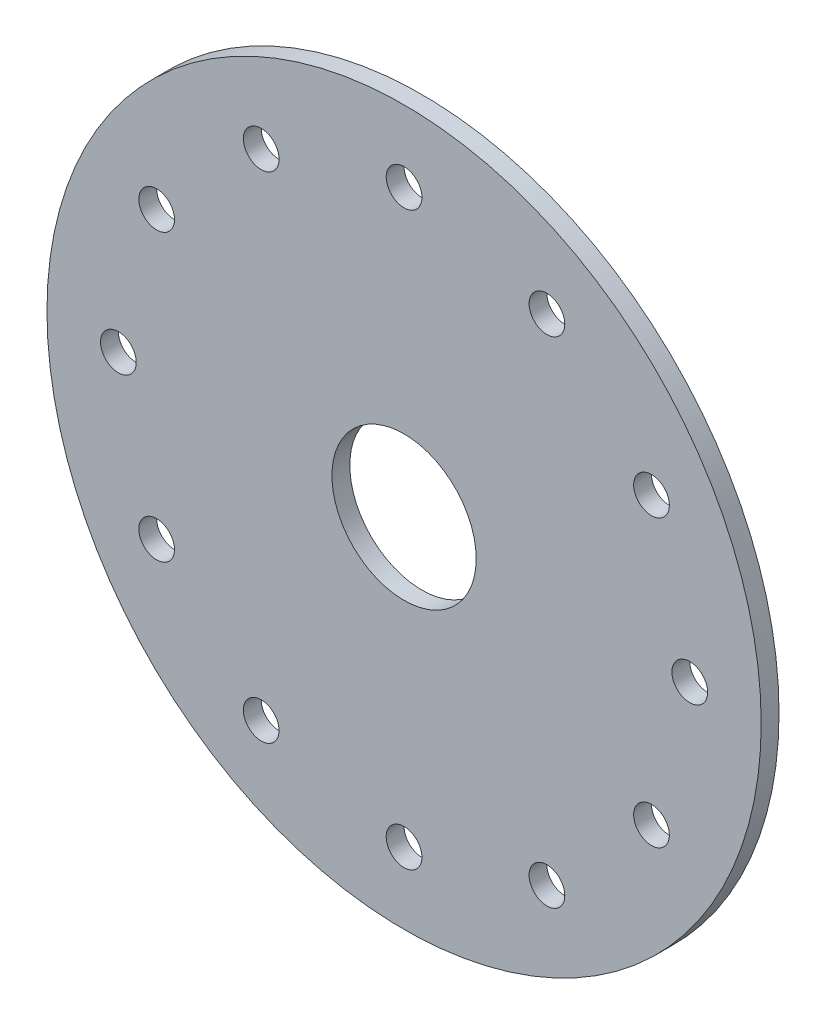
ISO-10303-21;
HEADER;
FILE_DESCRIPTION(('STEP AP214'),'2;1');
FILE_NAME('part.step','',(''),(''),'','','');
FILE_SCHEMA(('AUTOMOTIVE_DESIGN { 1 0 10303 214 1 1 1 1 }'));
ENDSEC;
DATA;
#1=APPLICATION_CONTEXT('core data for automotive mechanical design processes');
#2=APPLICATION_PROTOCOL_DEFINITION('international standard','automotive_design',2000,#1);
#3=PRODUCT_CONTEXT('',#1,'mechanical');
#4=PRODUCT('Part','Part','',(#3));
#5=PRODUCT_RELATED_PRODUCT_CATEGORY('part','',(#4));
#6=PRODUCT_DEFINITION_FORMATION('','',#4);
#7=PRODUCT_DEFINITION_CONTEXT('part definition',#1,'design');
#8=PRODUCT_DEFINITION('design','',#6,#7);
#9=PRODUCT_DEFINITION_SHAPE('','',#8);
#10=(LENGTH_UNIT() NAMED_UNIT(*) SI_UNIT(.MILLI.,.METRE.));
#11=(NAMED_UNIT(*) PLANE_ANGLE_UNIT() SI_UNIT($,.RADIAN.));
#12=(NAMED_UNIT(*) SI_UNIT($,.STERADIAN.) SOLID_ANGLE_UNIT());
#13=UNCERTAINTY_MEASURE_WITH_UNIT(LENGTH_MEASURE(1.E-05),#10,'distance_accuracy_value','');
#14=(GEOMETRIC_REPRESENTATION_CONTEXT(3) GLOBAL_UNCERTAINTY_ASSIGNED_CONTEXT((#13)) GLOBAL_UNIT_ASSIGNED_CONTEXT((#10,
#11,#12)) REPRESENTATION_CONTEXT('',''));
#15=CARTESIAN_POINT('',(0.,0.,0.));
#16=DIRECTION('',(0.,0.,1.));
#17=DIRECTION('',(1.,0.,0.));
#18=AXIS2_PLACEMENT_3D('',#15,#16,#17);
#19=CARTESIAN_POINT('',(-90.8107176198578,34.6539842080007,1.5875));
#20=DIRECTION('',(0.,0.,1.));
#21=DIRECTION('',(1.,0.,0.));
#22=AXIS2_PLACEMENT_3D('',#19,#20,#21);
#23=PLANE('',#22);
#24=CARTESIAN_POINT('',(-103.510717619857,56.6510294641236,1.5875));
#25=DIRECTION('',(0.,0.,1.));
#26=DIRECTION('',(1.,0.,0.));
#27=AXIS2_PLACEMENT_3D('',#24,#25,#26);
#28=CIRCLE('',#27,1.5875000000013);
#29=CARTESIAN_POINT('',(-101.923217619856,56.6510294641236,1.5875));
#30=VERTEX_POINT('',#29);
#31=EDGE_CURVE('E140',#30,#30,#28,.T.);
#32=ORIENTED_EDGE('',*,*,#31,.F.);
#33=EDGE_LOOP('',(#32));
#34=FACE_BOUND('',#33,.T.);
#35=CARTESIAN_POINT('',(-116.210717619854,34.6539842079971,1.5875));
#36=DIRECTION('',(0.,0.,1.));
#37=DIRECTION('',(1.,0.,0.));
#38=AXIS2_PLACEMENT_3D('',#35,#36,#37);
#39=CIRCLE('',#38,1.58750000000476);
#40=CARTESIAN_POINT('',(-114.623217619849,34.6539842079971,1.5875));
#41=VERTEX_POINT('',#40);
#42=EDGE_CURVE('E124',#41,#41,#39,.T.);
#43=ORIENTED_EDGE('',*,*,#42,.F.);
#44=EDGE_LOOP('',(#43));
#45=FACE_BOUND('',#44,.T.);
#46=CARTESIAN_POINT('',(-103.510717619851,12.6569389518742,1.5875));
#47=DIRECTION('',(0.,0.,1.));
#48=DIRECTION('',(1.,0.,0.));
#49=AXIS2_PLACEMENT_3D('',#46,#47,#48);
#50=CIRCLE('',#49,1.58750000000715);
#51=CARTESIAN_POINT('',(-101.923217619844,12.6569389518742,1.5875));
#52=VERTEX_POINT('',#51);
#53=EDGE_CURVE('E108',#52,#52,#50,.T.);
#54=ORIENTED_EDGE('',*,*,#53,.F.);
#55=EDGE_LOOP('',(#54));
#56=FACE_BOUND('',#55,.T.);
#57=CARTESIAN_POINT('',(-78.110717619851,12.6569389518778,1.5875));
#58=DIRECTION('',(0.,0.,1.));
#59=DIRECTION('',(1.,0.,0.));
#60=AXIS2_PLACEMENT_3D('',#57,#58,#59);
#61=CIRCLE('',#60,1.58750000000606);
#62=CARTESIAN_POINT('',(-76.523217619845,12.6569389518778,1.5875));
#63=VERTEX_POINT('',#62);
#64=EDGE_CURVE('E92',#63,#63,#61,.T.);
#65=ORIENTED_EDGE('',*,*,#64,.F.);
#66=EDGE_LOOP('',(#65));
#67=FACE_BOUND('',#66,.T.);
#68=CARTESIAN_POINT('',(-65.4107176198542,34.6539842080043,1.5875));
#69=DIRECTION('',(0.,0.,1.));
#70=DIRECTION('',(1.,0.,0.));
#71=AXIS2_PLACEMENT_3D('',#68,#69,#70);
#72=CIRCLE('',#71,1.58750000000248);
#73=CARTESIAN_POINT('',(-63.8232176198517,34.6539842080043,1.5875));
#74=VERTEX_POINT('',#73);
#75=EDGE_CURVE('E76',#74,#74,#72,.T.);
#76=ORIENTED_EDGE('',*,*,#75,.F.);
#77=EDGE_LOOP('',(#76));
#78=FACE_BOUND('',#77,.T.);
#79=CARTESIAN_POINT('',(-78.1107176198573,56.6510294641272,1.5875));
#80=DIRECTION('',(0.,0.,1.));
#81=DIRECTION('',(1.,0.,0.));
#82=AXIS2_PLACEMENT_3D('',#79,#80,#81);
#83=CIRCLE('',#82,1.58749999999995);
#84=CARTESIAN_POINT('',(-76.5232176198573,56.6510294641272,1.5875));
#85=VERTEX_POINT('',#84);
#86=EDGE_CURVE('E60',#85,#85,#83,.T.);
#87=ORIENTED_EDGE('',*,*,#86,.F.);
#88=EDGE_LOOP('',(#87));
#89=FACE_BOUND('',#88,.T.);
#90=CARTESIAN_POINT('',(-90.8107176198578,34.6539842080007,1.5875));
#91=DIRECTION('',(0.,0.,1.));
#92=DIRECTION('',(1.,0.,0.));
#93=AXIS2_PLACEMENT_3D('',#90,#91,#92);
#94=CIRCLE('',#93,31.75);
#95=CARTESIAN_POINT('',(-59.0607176198578,34.6539842080007,1.5875));
#96=VERTEX_POINT('',#95);
#97=EDGE_CURVE('E10',#96,#96,#94,.T.);
#98=ORIENTED_EDGE('',*,*,#97,.T.);
#99=EDGE_LOOP('',(#98));
#100=FACE_BOUND('',#99,.T.);
#101=CARTESIAN_POINT('',(-90.8107176198578,60.0539842080007,1.5875));
#102=DIRECTION('',(0.,0.,1.));
#103=DIRECTION('',(1.,0.,0.));
#104=AXIS2_PLACEMENT_3D('',#101,#102,#103);
#105=CIRCLE('',#104,1.5875);
#106=CARTESIAN_POINT('',(-89.2232176198578,60.0539842080007,1.5875));
#107=VERTEX_POINT('',#106);
#108=EDGE_CURVE('E54',#107,#107,#105,.T.);
#109=ORIENTED_EDGE('',*,*,#108,.F.);
#110=EDGE_LOOP('',(#109));
#111=FACE_BOUND('',#110,.T.);
#112=CARTESIAN_POINT('',(-68.8136723637312,47.3539842080038,1.5875));
#113=DIRECTION('',(0.,0.,1.));
#114=DIRECTION('',(1.,0.,0.));
#115=AXIS2_PLACEMENT_3D('',#112,#113,#114);
#116=CIRCLE('',#115,1.58750000000086);
#117=CARTESIAN_POINT('',(-67.2261723637304,47.3539842080038,1.5875));
#118=VERTEX_POINT('',#117);
#119=EDGE_CURVE('E68',#118,#118,#116,.T.);
#120=ORIENTED_EDGE('',*,*,#119,.F.);
#121=EDGE_LOOP('',(#120));
#122=FACE_BOUND('',#121,.T.);
#123=CARTESIAN_POINT('',(-68.8136723637276,21.9539842080038,1.5875));
#124=DIRECTION('',(0.,0.,1.));
#125=DIRECTION('',(1.,0.,0.));
#126=AXIS2_PLACEMENT_3D('',#123,#124,#125);
#127=CIRCLE('',#126,1.58750000000438);
#128=CARTESIAN_POINT('',(-67.2261723637233,21.9539842080038,1.5875));
#129=VERTEX_POINT('',#128);
#130=EDGE_CURVE('E84',#129,#129,#127,.T.);
#131=ORIENTED_EDGE('',*,*,#130,.F.);
#132=EDGE_LOOP('',(#131));
#133=FACE_BOUND('',#132,.T.);
#134=CARTESIAN_POINT('',(-90.8107176198506,9.2539842080007,1.5875));
#135=DIRECTION('',(0.,0.,1.));
#136=DIRECTION('',(1.,0.,0.));
#137=AXIS2_PLACEMENT_3D('',#134,#135,#136);
#138=CIRCLE('',#137,1.58750000000707);
#139=CARTESIAN_POINT('',(-89.2232176198435,9.2539842080007,1.5875));
#140=VERTEX_POINT('',#139);
#141=EDGE_CURVE('E100',#140,#140,#138,.T.);
#142=ORIENTED_EDGE('',*,*,#141,.F.);
#143=EDGE_LOOP('',(#142));
#144=FACE_BOUND('',#143,.T.);
#145=CARTESIAN_POINT('',(-112.807762875977,21.9539842079976,1.5875));
#146=DIRECTION('',(0.,0.,1.));
#147=DIRECTION('',(1.,0.,0.));
#148=AXIS2_PLACEMENT_3D('',#145,#146,#147);
#149=CIRCLE('',#148,1.58750000000632);
#150=CARTESIAN_POINT('',(-111.220262875971,21.9539842079976,1.5875));
#151=VERTEX_POINT('',#150);
#152=EDGE_CURVE('E116',#151,#151,#149,.T.);
#153=ORIENTED_EDGE('',*,*,#152,.F.);
#154=EDGE_LOOP('',(#153));
#155=FACE_BOUND('',#154,.T.);
#156=CARTESIAN_POINT('',(-112.807762875981,47.3539842079976,1.5875));
#157=DIRECTION('',(0.,0.,1.));
#158=DIRECTION('',(1.,0.,0.));
#159=AXIS2_PLACEMENT_3D('',#156,#157,#158);
#160=CIRCLE('',#159,1.58750000000294);
#161=CARTESIAN_POINT('',(-111.220262875978,47.3539842079976,1.5875));
#162=VERTEX_POINT('',#161);
#163=EDGE_CURVE('E132',#162,#162,#160,.T.);
#164=ORIENTED_EDGE('',*,*,#163,.F.);
#165=EDGE_LOOP('',(#164));
#166=FACE_BOUND('',#165,.T.);
#167=CARTESIAN_POINT('',(-90.8107176198578,34.6539842080007,1.5875));
#168=DIRECTION('',(0.,0.,1.));
#169=DIRECTION('',(1.,0.,0.));
#170=AXIS2_PLACEMENT_3D('',#167,#168,#169);
#171=CIRCLE('',#170,6.4135);
#172=CARTESIAN_POINT('',(-84.3972176198578,34.6539842080007,1.5875));
#173=VERTEX_POINT('',#172);
#174=EDGE_CURVE('E148',#173,#173,#171,.T.);
#175=ORIENTED_EDGE('',*,*,#174,.F.);
#176=EDGE_LOOP('',(#175));
#177=FACE_BOUND('',#176,.T.);
#178=ADVANCED_FACE('F41',(#34,#45,#56,#67,#78,#89,#100,#111,#122,#133,#144,#155,#166,#177),#23,.T.);
#179=CARTESIAN_POINT('',(-90.8107176198578,34.6539842080007,0.));
#180=DIRECTION('',(0.,0.,1.));
#181=DIRECTION('',(1.,0.,0.));
#182=AXIS2_PLACEMENT_3D('',#179,#180,#181);
#183=PLANE('',#182);
#184=CARTESIAN_POINT('',(-90.8107176198578,34.6539842080007,0.));
#185=DIRECTION('',(0.,0.,1.));
#186=DIRECTION('',(1.,0.,0.));
#187=AXIS2_PLACEMENT_3D('',#184,#185,#186);
#188=CIRCLE('',#187,31.75);
#189=CARTESIAN_POINT('',(-59.0607176198578,34.6539842080007,0.));
#190=VERTEX_POINT('',#189);
#191=EDGE_CURVE('E45',#190,#190,#188,.T.);
#192=ORIENTED_EDGE('',*,*,#191,.F.);
#193=EDGE_LOOP('',(#192));
#194=FACE_BOUND('',#193,.T.);
#195=CARTESIAN_POINT('',(-90.8107176198578,60.0539842080007,0.));
#196=DIRECTION('',(0.,0.,1.));
#197=DIRECTION('',(1.,0.,0.));
#198=AXIS2_PLACEMENT_3D('',#195,#196,#197);
#199=CIRCLE('',#198,1.5875);
#200=CARTESIAN_POINT('',(-89.2232176198578,60.0539842080007,0.));
#201=VERTEX_POINT('',#200);
#202=EDGE_CURVE('E56',#201,#201,#199,.T.);
#203=ORIENTED_EDGE('',*,*,#202,.T.);
#204=EDGE_LOOP('',(#203));
#205=FACE_BOUND('',#204,.T.);
#206=CARTESIAN_POINT('',(-78.1107176198573,56.6510294641272,0.));
#207=DIRECTION('',(0.,0.,1.));
#208=DIRECTION('',(1.,0.,0.));
#209=AXIS2_PLACEMENT_3D('',#206,#207,#208);
#210=CIRCLE('',#209,1.58749999999995);
#211=CARTESIAN_POINT('',(-76.5232176198573,56.6510294641272,0.));
#212=VERTEX_POINT('',#211);
#213=EDGE_CURVE('E64',#212,#212,#210,.T.);
#214=ORIENTED_EDGE('',*,*,#213,.T.);
#215=EDGE_LOOP('',(#214));
#216=FACE_BOUND('',#215,.T.);
#217=CARTESIAN_POINT('',(-68.8136723637312,47.3539842080038,0.));
#218=DIRECTION('',(0.,0.,1.));
#219=DIRECTION('',(1.,0.,0.));
#220=AXIS2_PLACEMENT_3D('',#217,#218,#219);
#221=CIRCLE('',#220,1.58750000000086);
#222=CARTESIAN_POINT('',(-67.2261723637304,47.3539842080038,0.));
#223=VERTEX_POINT('',#222);
#224=EDGE_CURVE('E72',#223,#223,#221,.T.);
#225=ORIENTED_EDGE('',*,*,#224,.T.);
#226=EDGE_LOOP('',(#225));
#227=FACE_BOUND('',#226,.T.);
#228=CARTESIAN_POINT('',(-65.4107176198542,34.6539842080043,0.));
#229=DIRECTION('',(0.,0.,1.));
#230=DIRECTION('',(1.,0.,0.));
#231=AXIS2_PLACEMENT_3D('',#228,#229,#230);
#232=CIRCLE('',#231,1.58750000000248);
#233=CARTESIAN_POINT('',(-63.8232176198517,34.6539842080043,0.));
#234=VERTEX_POINT('',#233);
#235=EDGE_CURVE('E80',#234,#234,#232,.T.);
#236=ORIENTED_EDGE('',*,*,#235,.T.);
#237=EDGE_LOOP('',(#236));
#238=FACE_BOUND('',#237,.T.);
#239=CARTESIAN_POINT('',(-68.8136723637276,21.9539842080038,0.));
#240=DIRECTION('',(0.,0.,1.));
#241=DIRECTION('',(1.,0.,0.));
#242=AXIS2_PLACEMENT_3D('',#239,#240,#241);
#243=CIRCLE('',#242,1.58750000000438);
#244=CARTESIAN_POINT('',(-67.2261723637233,21.9539842080038,0.));
#245=VERTEX_POINT('',#244);
#246=EDGE_CURVE('E88',#245,#245,#243,.T.);
#247=ORIENTED_EDGE('',*,*,#246,.T.);
#248=EDGE_LOOP('',(#247));
#249=FACE_BOUND('',#248,.T.);
#250=CARTESIAN_POINT('',(-78.110717619851,12.6569389518778,0.));
#251=DIRECTION('',(0.,0.,1.));
#252=DIRECTION('',(1.,0.,0.));
#253=AXIS2_PLACEMENT_3D('',#250,#251,#252);
#254=CIRCLE('',#253,1.58750000000606);
#255=CARTESIAN_POINT('',(-76.523217619845,12.6569389518778,0.));
#256=VERTEX_POINT('',#255);
#257=EDGE_CURVE('E96',#256,#256,#254,.T.);
#258=ORIENTED_EDGE('',*,*,#257,.T.);
#259=EDGE_LOOP('',(#258));
#260=FACE_BOUND('',#259,.T.);
#261=CARTESIAN_POINT('',(-90.8107176198506,9.2539842080007,0.));
#262=DIRECTION('',(0.,0.,1.));
#263=DIRECTION('',(1.,0.,0.));
#264=AXIS2_PLACEMENT_3D('',#261,#262,#263);
#265=CIRCLE('',#264,1.58750000000707);
#266=CARTESIAN_POINT('',(-89.2232176198435,9.2539842080007,0.));
#267=VERTEX_POINT('',#266);
#268=EDGE_CURVE('E104',#267,#267,#265,.T.);
#269=ORIENTED_EDGE('',*,*,#268,.T.);
#270=EDGE_LOOP('',(#269));
#271=FACE_BOUND('',#270,.T.);
#272=CARTESIAN_POINT('',(-103.510717619851,12.6569389518742,0.));
#273=DIRECTION('',(0.,0.,1.));
#274=DIRECTION('',(1.,0.,0.));
#275=AXIS2_PLACEMENT_3D('',#272,#273,#274);
#276=CIRCLE('',#275,1.58750000000715);
#277=CARTESIAN_POINT('',(-101.923217619844,12.6569389518742,0.));
#278=VERTEX_POINT('',#277);
#279=EDGE_CURVE('E112',#278,#278,#276,.T.);
#280=ORIENTED_EDGE('',*,*,#279,.T.);
#281=EDGE_LOOP('',(#280));
#282=FACE_BOUND('',#281,.T.);
#283=CARTESIAN_POINT('',(-112.807762875977,21.9539842079976,0.));
#284=DIRECTION('',(0.,0.,1.));
#285=DIRECTION('',(1.,0.,0.));
#286=AXIS2_PLACEMENT_3D('',#283,#284,#285);
#287=CIRCLE('',#286,1.58750000000632);
#288=CARTESIAN_POINT('',(-111.220262875971,21.9539842079976,0.));
#289=VERTEX_POINT('',#288);
#290=EDGE_CURVE('E120',#289,#289,#287,.T.);
#291=ORIENTED_EDGE('',*,*,#290,.T.);
#292=EDGE_LOOP('',(#291));
#293=FACE_BOUND('',#292,.T.);
#294=CARTESIAN_POINT('',(-116.210717619854,34.6539842079971,0.));
#295=DIRECTION('',(0.,0.,1.));
#296=DIRECTION('',(1.,0.,0.));
#297=AXIS2_PLACEMENT_3D('',#294,#295,#296);
#298=CIRCLE('',#297,1.58750000000476);
#299=CARTESIAN_POINT('',(-114.623217619849,34.6539842079971,0.));
#300=VERTEX_POINT('',#299);
#301=EDGE_CURVE('E128',#300,#300,#298,.T.);
#302=ORIENTED_EDGE('',*,*,#301,.T.);
#303=EDGE_LOOP('',(#302));
#304=FACE_BOUND('',#303,.T.);
#305=CARTESIAN_POINT('',(-112.807762875981,47.3539842079976,0.));
#306=DIRECTION('',(0.,0.,1.));
#307=DIRECTION('',(1.,0.,0.));
#308=AXIS2_PLACEMENT_3D('',#305,#306,#307);
#309=CIRCLE('',#308,1.58750000000294);
#310=CARTESIAN_POINT('',(-111.220262875978,47.3539842079976,0.));
#311=VERTEX_POINT('',#310);
#312=EDGE_CURVE('E136',#311,#311,#309,.T.);
#313=ORIENTED_EDGE('',*,*,#312,.T.);
#314=EDGE_LOOP('',(#313));
#315=FACE_BOUND('',#314,.T.);
#316=CARTESIAN_POINT('',(-103.510717619857,56.6510294641236,0.));
#317=DIRECTION('',(0.,0.,1.));
#318=DIRECTION('',(1.,0.,0.));
#319=AXIS2_PLACEMENT_3D('',#316,#317,#318);
#320=CIRCLE('',#319,1.5875000000013);
#321=CARTESIAN_POINT('',(-101.923217619856,56.6510294641236,0.));
#322=VERTEX_POINT('',#321);
#323=EDGE_CURVE('E144',#322,#322,#320,.T.);
#324=ORIENTED_EDGE('',*,*,#323,.T.);
#325=EDGE_LOOP('',(#324));
#326=FACE_BOUND('',#325,.T.);
#327=CARTESIAN_POINT('',(-90.8107176198578,34.6539842080007,0.));
#328=DIRECTION('',(0.,0.,1.));
#329=DIRECTION('',(1.,0.,0.));
#330=AXIS2_PLACEMENT_3D('',#327,#328,#329);
#331=CIRCLE('',#330,6.4135);
#332=CARTESIAN_POINT('',(-84.3972176198578,34.6539842080007,0.));
#333=VERTEX_POINT('',#332);
#334=EDGE_CURVE('E152',#333,#333,#331,.T.);
#335=ORIENTED_EDGE('',*,*,#334,.T.);
#336=EDGE_LOOP('',(#335));
#337=FACE_BOUND('',#336,.T.);
#338=ADVANCED_FACE('F164',(#194,#205,#216,#227,#238,#249,#260,#271,#282,#293,#304,#315,#326,
#337),#183,.F.);
#339=CARTESIAN_POINT('',(-90.8107176198578,34.6539842080007,1.5875));
#340=DIRECTION('',(0.,0.,-1.));
#341=DIRECTION('',(-1.,0.,0.));
#342=AXIS2_PLACEMENT_3D('',#339,#340,#341);
#343=CYLINDRICAL_SURFACE('',#342,31.75);
#344=ORIENTED_EDGE('',*,*,#97,.F.);
#345=EDGE_LOOP('',(#344));
#346=FACE_BOUND('',#345,.T.);
#347=ORIENTED_EDGE('',*,*,#191,.T.);
#348=EDGE_LOOP('',(#347));
#349=FACE_BOUND('',#348,.T.);
#350=ADVANCED_FACE('F43',(#346,#349),#343,.T.);
#351=CARTESIAN_POINT('',(-90.8107176198578,60.0539842080007,1.5875));
#352=DIRECTION('',(0.,0.,-1.));
#353=DIRECTION('',(-1.,0.,0.));
#354=AXIS2_PLACEMENT_3D('',#351,#352,#353);
#355=CYLINDRICAL_SURFACE('',#354,1.5875);
#356=ORIENTED_EDGE('',*,*,#108,.T.);
#357=EDGE_LOOP('',(#356));
#358=FACE_BOUND('',#357,.T.);
#359=ORIENTED_EDGE('',*,*,#202,.F.);
#360=EDGE_LOOP('',(#359));
#361=FACE_BOUND('',#360,.T.);
#362=ADVANCED_FACE('F174',(#358,#361),#355,.F.);
#363=CARTESIAN_POINT('',(-78.1107176198573,56.6510294641272,1.5875));
#364=DIRECTION('',(0.,0.,-1.));
#365=DIRECTION('',(-1.,0.,0.));
#366=AXIS2_PLACEMENT_3D('',#363,#364,#365);
#367=CYLINDRICAL_SURFACE('',#366,1.58749999999995);
#368=ORIENTED_EDGE('',*,*,#86,.T.);
#369=EDGE_LOOP('',(#368));
#370=FACE_BOUND('',#369,.T.);
#371=ORIENTED_EDGE('',*,*,#213,.F.);
#372=EDGE_LOOP('',(#371));
#373=FACE_BOUND('',#372,.T.);
#374=ADVANCED_FACE('F177',(#370,#373),#367,.F.);
#375=CARTESIAN_POINT('',(-68.8136723637312,47.3539842080038,1.5875));
#376=DIRECTION('',(0.,0.,-1.));
#377=DIRECTION('',(-1.,0.,0.));
#378=AXIS2_PLACEMENT_3D('',#375,#376,#377);
#379=CYLINDRICAL_SURFACE('',#378,1.58750000000086);
#380=ORIENTED_EDGE('',*,*,#119,.T.);
#381=EDGE_LOOP('',(#380));
#382=FACE_BOUND('',#381,.T.);
#383=ORIENTED_EDGE('',*,*,#224,.F.);
#384=EDGE_LOOP('',(#383));
#385=FACE_BOUND('',#384,.T.);
#386=ADVANCED_FACE('F181',(#382,#385),#379,.F.);
#387=CARTESIAN_POINT('',(-65.4107176198542,34.6539842080043,1.5875));
#388=DIRECTION('',(0.,0.,-1.));
#389=DIRECTION('',(-1.,0.,0.));
#390=AXIS2_PLACEMENT_3D('',#387,#388,#389);
#391=CYLINDRICAL_SURFACE('',#390,1.58750000000248);
#392=ORIENTED_EDGE('',*,*,#75,.T.);
#393=EDGE_LOOP('',(#392));
#394=FACE_BOUND('',#393,.T.);
#395=ORIENTED_EDGE('',*,*,#235,.F.);
#396=EDGE_LOOP('',(#395));
#397=FACE_BOUND('',#396,.T.);
#398=ADVANCED_FACE('F185',(#394,#397),#391,.F.);
#399=CARTESIAN_POINT('',(-68.8136723637276,21.9539842080038,1.5875));
#400=DIRECTION('',(0.,0.,-1.));
#401=DIRECTION('',(-1.,0.,0.));
#402=AXIS2_PLACEMENT_3D('',#399,#400,#401);
#403=CYLINDRICAL_SURFACE('',#402,1.58750000000438);
#404=ORIENTED_EDGE('',*,*,#130,.T.);
#405=EDGE_LOOP('',(#404));
#406=FACE_BOUND('',#405,.T.);
#407=ORIENTED_EDGE('',*,*,#246,.F.);
#408=EDGE_LOOP('',(#407));
#409=FACE_BOUND('',#408,.T.);
#410=ADVANCED_FACE('F189',(#406,#409),#403,.F.);
#411=CARTESIAN_POINT('',(-78.110717619851,12.6569389518778,1.5875));
#412=DIRECTION('',(0.,0.,-1.));
#413=DIRECTION('',(-1.,0.,0.));
#414=AXIS2_PLACEMENT_3D('',#411,#412,#413);
#415=CYLINDRICAL_SURFACE('',#414,1.58750000000606);
#416=ORIENTED_EDGE('',*,*,#64,.T.);
#417=EDGE_LOOP('',(#416));
#418=FACE_BOUND('',#417,.T.);
#419=ORIENTED_EDGE('',*,*,#257,.F.);
#420=EDGE_LOOP('',(#419));
#421=FACE_BOUND('',#420,.T.);
#422=ADVANCED_FACE('F193',(#418,#421),#415,.F.);
#423=CARTESIAN_POINT('',(-90.8107176198506,9.2539842080007,1.5875));
#424=DIRECTION('',(0.,0.,-1.));
#425=DIRECTION('',(-1.,0.,0.));
#426=AXIS2_PLACEMENT_3D('',#423,#424,#425);
#427=CYLINDRICAL_SURFACE('',#426,1.58750000000707);
#428=ORIENTED_EDGE('',*,*,#141,.T.);
#429=EDGE_LOOP('',(#428));
#430=FACE_BOUND('',#429,.T.);
#431=ORIENTED_EDGE('',*,*,#268,.F.);
#432=EDGE_LOOP('',(#431));
#433=FACE_BOUND('',#432,.T.);
#434=ADVANCED_FACE('F197',(#430,#433),#427,.F.);
#435=CARTESIAN_POINT('',(-103.510717619851,12.6569389518742,1.5875));
#436=DIRECTION('',(0.,0.,-1.));
#437=DIRECTION('',(-1.,0.,0.));
#438=AXIS2_PLACEMENT_3D('',#435,#436,#437);
#439=CYLINDRICAL_SURFACE('',#438,1.58750000000715);
#440=ORIENTED_EDGE('',*,*,#53,.T.);
#441=EDGE_LOOP('',(#440));
#442=FACE_BOUND('',#441,.T.);
#443=ORIENTED_EDGE('',*,*,#279,.F.);
#444=EDGE_LOOP('',(#443));
#445=FACE_BOUND('',#444,.T.);
#446=ADVANCED_FACE('F201',(#442,#445),#439,.F.);
#447=CARTESIAN_POINT('',(-112.807762875977,21.9539842079976,1.5875));
#448=DIRECTION('',(0.,0.,-1.));
#449=DIRECTION('',(-1.,0.,0.));
#450=AXIS2_PLACEMENT_3D('',#447,#448,#449);
#451=CYLINDRICAL_SURFACE('',#450,1.58750000000632);
#452=ORIENTED_EDGE('',*,*,#152,.T.);
#453=EDGE_LOOP('',(#452));
#454=FACE_BOUND('',#453,.T.);
#455=ORIENTED_EDGE('',*,*,#290,.F.);
#456=EDGE_LOOP('',(#455));
#457=FACE_BOUND('',#456,.T.);
#458=ADVANCED_FACE('F205',(#454,#457),#451,.F.);
#459=CARTESIAN_POINT('',(-116.210717619854,34.6539842079971,1.5875));
#460=DIRECTION('',(0.,0.,-1.));
#461=DIRECTION('',(-1.,0.,0.));
#462=AXIS2_PLACEMENT_3D('',#459,#460,#461);
#463=CYLINDRICAL_SURFACE('',#462,1.58750000000476);
#464=ORIENTED_EDGE('',*,*,#42,.T.);
#465=EDGE_LOOP('',(#464));
#466=FACE_BOUND('',#465,.T.);
#467=ORIENTED_EDGE('',*,*,#301,.F.);
#468=EDGE_LOOP('',(#467));
#469=FACE_BOUND('',#468,.T.);
#470=ADVANCED_FACE('F209',(#466,#469),#463,.F.);
#471=CARTESIAN_POINT('',(-112.807762875981,47.3539842079976,1.5875));
#472=DIRECTION('',(0.,0.,-1.));
#473=DIRECTION('',(-1.,0.,0.));
#474=AXIS2_PLACEMENT_3D('',#471,#472,#473);
#475=CYLINDRICAL_SURFACE('',#474,1.58750000000294);
#476=ORIENTED_EDGE('',*,*,#163,.T.);
#477=EDGE_LOOP('',(#476));
#478=FACE_BOUND('',#477,.T.);
#479=ORIENTED_EDGE('',*,*,#312,.F.);
#480=EDGE_LOOP('',(#479));
#481=FACE_BOUND('',#480,.T.);
#482=ADVANCED_FACE('F213',(#478,#481),#475,.F.);
#483=CARTESIAN_POINT('',(-103.510717619857,56.6510294641236,1.5875));
#484=DIRECTION('',(0.,0.,-1.));
#485=DIRECTION('',(-1.,0.,0.));
#486=AXIS2_PLACEMENT_3D('',#483,#484,#485);
#487=CYLINDRICAL_SURFACE('',#486,1.5875000000013);
#488=ORIENTED_EDGE('',*,*,#31,.T.);
#489=EDGE_LOOP('',(#488));
#490=FACE_BOUND('',#489,.T.);
#491=ORIENTED_EDGE('',*,*,#323,.F.);
#492=EDGE_LOOP('',(#491));
#493=FACE_BOUND('',#492,.T.);
#494=ADVANCED_FACE('F217',(#490,#493),#487,.F.);
#495=CARTESIAN_POINT('',(-90.8107176198578,34.6539842080007,1.5875));
#496=DIRECTION('',(0.,0.,-1.));
#497=DIRECTION('',(-1.,0.,0.));
#498=AXIS2_PLACEMENT_3D('',#495,#496,#497);
#499=CYLINDRICAL_SURFACE('',#498,6.4135);
#500=ORIENTED_EDGE('',*,*,#174,.T.);
#501=EDGE_LOOP('',(#500));
#502=FACE_BOUND('',#501,.T.);
#503=ORIENTED_EDGE('',*,*,#334,.F.);
#504=EDGE_LOOP('',(#503));
#505=FACE_BOUND('',#504,.T.);
#506=ADVANCED_FACE('F160',(#502,#505),#499,.F.);
#507=CLOSED_SHELL('',(#178,#338,#350,#362,#374,#386,#398,#410,#422,#434,#446,#458,#470,#482,
#494,#506));
#508=MANIFOLD_SOLID_BREP('B2',#507);
#509=ADVANCED_BREP_SHAPE_REPRESENTATION('',(#18,#508),#14);
#510=SHAPE_DEFINITION_REPRESENTATION(#9,#509);
ENDSEC;
END-ISO-10303-21;
